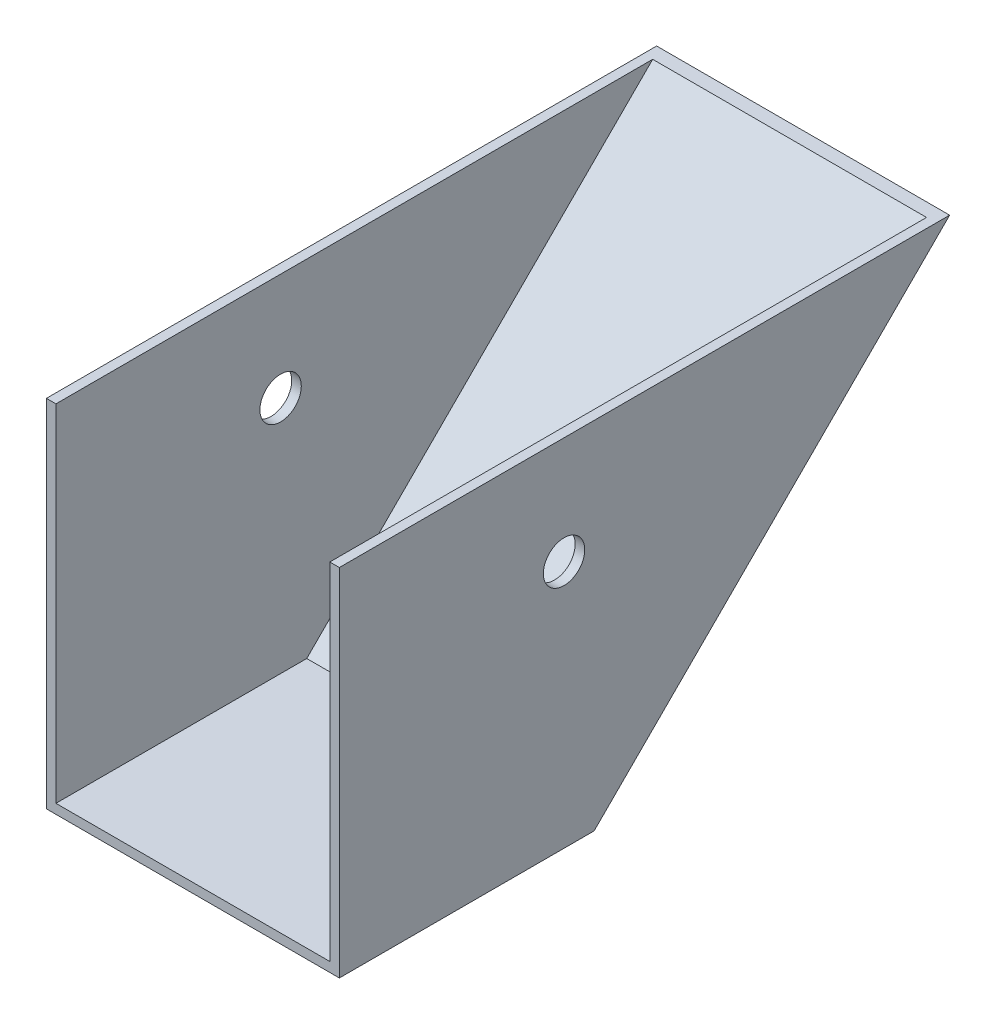
ISO-10303-21;
HEADER;
FILE_DESCRIPTION(('STEP AP214'),'2;1');
FILE_NAME('part.step','',(''),(''),'','','');
FILE_SCHEMA(('AUTOMOTIVE_DESIGN { 1 0 10303 214 1 1 1 1 }'));
ENDSEC;
DATA;
#1=APPLICATION_CONTEXT('core data for automotive mechanical design processes');
#2=APPLICATION_PROTOCOL_DEFINITION('international standard','automotive_design',2000,#1);
#3=PRODUCT_CONTEXT('',#1,'mechanical');
#4=PRODUCT('Part','Part','',(#3));
#5=PRODUCT_RELATED_PRODUCT_CATEGORY('part','',(#4));
#6=PRODUCT_DEFINITION_FORMATION('','',#4);
#7=PRODUCT_DEFINITION_CONTEXT('part definition',#1,'design');
#8=PRODUCT_DEFINITION('design','',#6,#7);
#9=PRODUCT_DEFINITION_SHAPE('','',#8);
#10=(LENGTH_UNIT() NAMED_UNIT(*) SI_UNIT(.MILLI.,.METRE.));
#11=(NAMED_UNIT(*) PLANE_ANGLE_UNIT() SI_UNIT($,.RADIAN.));
#12=(NAMED_UNIT(*) SI_UNIT($,.STERADIAN.) SOLID_ANGLE_UNIT());
#13=UNCERTAINTY_MEASURE_WITH_UNIT(LENGTH_MEASURE(1.E-05),#10,'distance_accuracy_value','');
#14=(GEOMETRIC_REPRESENTATION_CONTEXT(3) GLOBAL_UNCERTAINTY_ASSIGNED_CONTEXT((#13)) GLOBAL_UNIT_ASSIGNED_CONTEXT((#10,
#11,#12)) REPRESENTATION_CONTEXT('',''));
#15=CARTESIAN_POINT('',(0.,0.,0.));
#16=DIRECTION('',(0.,0.,1.));
#17=DIRECTION('',(1.,0.,0.));
#18=AXIS2_PLACEMENT_3D('',#15,#16,#17);
#19=CARTESIAN_POINT('',(-146.05,190.5,317.5));
#20=DIRECTION('',(0.,0.,-1.));
#21=DIRECTION('',(-1.,0.,0.));
#22=AXIS2_PLACEMENT_3D('',#19,#20,#21);
#23=PLANE('',#22);
#24=DIRECTION('',(1.,0.,0.));
#25=VECTOR('',#24,1.);
#26=CARTESIAN_POINT('',(-146.05,163.914666666667,317.5));
#27=LINE('',#26,#25);
#28=CARTESIAN_POINT('',(-146.05,163.914666666667,317.5));
#29=VERTEX_POINT('',#28);
#30=CARTESIAN_POINT('',(-136.525,163.914666666667,317.5));
#31=VERTEX_POINT('',#30);
#32=EDGE_CURVE('E100',#29,#31,#27,.T.);
#33=ORIENTED_EDGE('',*,*,#32,.F.);
#34=DIRECTION('',(0.,-1.,0.));
#35=VECTOR('',#34,1.);
#36=CARTESIAN_POINT('',(-146.05,190.5,317.5));
#37=LINE('',#36,#35);
#38=CARTESIAN_POINT('',(-146.05,-190.5,317.5));
#39=VERTEX_POINT('',#38);
#40=EDGE_CURVE('E111',#29,#39,#37,.T.);
#41=ORIENTED_EDGE('',*,*,#40,.T.);
#42=DIRECTION('',(1.,0.,0.));
#43=VECTOR('',#42,1.);
#44=CARTESIAN_POINT('',(-146.05,-190.5,317.5));
#45=LINE('',#44,#43);
#46=CARTESIAN_POINT('',(146.05,-190.5,317.5));
#47=VERTEX_POINT('',#46);
#48=EDGE_CURVE('E124',#39,#47,#45,.T.);
#49=ORIENTED_EDGE('',*,*,#48,.T.);
#50=DIRECTION('',(0.,-1.,0.));
#51=VECTOR('',#50,1.);
#52=CARTESIAN_POINT('',(146.05,190.5,317.5));
#53=LINE('',#52,#51);
#54=CARTESIAN_POINT('',(146.05,163.914666666667,317.5));
#55=VERTEX_POINT('',#54);
#56=EDGE_CURVE('E121',#55,#47,#53,.T.);
#57=ORIENTED_EDGE('',*,*,#56,.F.);
#58=CARTESIAN_POINT('',(136.525,163.914666666667,317.5));
#59=VERTEX_POINT('',#58);
#60=EDGE_CURVE('E106',#59,#55,#27,.T.);
#61=ORIENTED_EDGE('',*,*,#60,.F.);
#62=DIRECTION('',(0.,-1.,0.));
#63=VECTOR('',#62,1.);
#64=CARTESIAN_POINT('',(136.525,190.5,317.5));
#65=LINE('',#64,#63);
#66=CARTESIAN_POINT('',(136.525,-180.975,317.5));
#67=VERTEX_POINT('',#66);
#68=EDGE_CURVE('E162',#59,#67,#65,.T.);
#69=ORIENTED_EDGE('',*,*,#68,.T.);
#70=DIRECTION('',(1.,0.,0.));
#71=VECTOR('',#70,1.);
#72=CARTESIAN_POINT('',(0.,-180.975,317.5));
#73=LINE('',#72,#71);
#74=CARTESIAN_POINT('',(-136.525,-180.975,317.5));
#75=VERTEX_POINT('',#74);
#76=EDGE_CURVE('E158',#75,#67,#73,.T.);
#77=ORIENTED_EDGE('',*,*,#76,.F.);
#78=DIRECTION('',(0.,-1.,0.));
#79=VECTOR('',#78,1.);
#80=CARTESIAN_POINT('',(-136.525,190.5,317.5));
#81=LINE('',#80,#79);
#82=EDGE_CURVE('E114',#31,#75,#81,.T.);
#83=ORIENTED_EDGE('',*,*,#82,.F.);
#84=EDGE_LOOP('',(#33,#41,#49,#57,#61,#69,#77,#83));
#85=FACE_BOUND('',#84,.T.);
#86=ADVANCED_FACE('F34',(#85),#23,.F.);
#87=CARTESIAN_POINT('',(146.05,190.5,317.5));
#88=DIRECTION('',(-1.,0.,0.));
#89=DIRECTION('',(0.,0.,1.));
#90=AXIS2_PLACEMENT_3D('',#87,#88,#89);
#91=PLANE('',#90);
#92=CARTESIAN_POINT('',(146.05,56.9612089146503,93.5172925237751));
#93=DIRECTION('',(-1.,0.,0.));
#94=DIRECTION('',(0.,0.,1.));
#95=AXIS2_PLACEMENT_3D('',#92,#93,#94);
#96=CIRCLE('',#95,20.6375);
#97=CARTESIAN_POINT('',(146.05,56.9612089146503,114.154792523775));
#98=VERTEX_POINT('',#97);
#99=EDGE_CURVE('E134',#98,#98,#96,.T.);
#100=ORIENTED_EDGE('',*,*,#99,.T.);
#101=EDGE_LOOP('',(#100));
#102=FACE_BOUND('',#101,.T.);
#103=DIRECTION('',(0.,0.,-1.));
#104=VECTOR('',#103,1.);
#105=CARTESIAN_POINT('',(146.05,163.914666666667,-292.608));
#106=LINE('',#105,#104);
#107=CARTESIAN_POINT('',(146.05,163.914666666667,-290.914666666667));
#108=VERTEX_POINT('',#107);
#109=EDGE_CURVE('E115',#55,#108,#106,.T.);
#110=ORIENTED_EDGE('',*,*,#109,.F.);
#111=ORIENTED_EDGE('',*,*,#56,.T.);
#112=DIRECTION('',(0.,0.,-1.));
#113=VECTOR('',#112,1.);
#114=CARTESIAN_POINT('',(146.05,-190.5,317.5));
#115=LINE('',#114,#113);
#116=CARTESIAN_POINT('',(146.05,-190.5,63.5000000000015));
#117=VERTEX_POINT('',#116);
#118=EDGE_CURVE('E169',#47,#117,#115,.T.);
#119=ORIENTED_EDGE('',*,*,#118,.T.);
#120=DIRECTION('',(0.,0.707106781186546,-0.707106781186549));
#121=VECTOR('',#120,1.);
#122=CARTESIAN_POINT('',(146.05,-127.,1.16573417585641E-12));
#123=LINE('',#122,#121);
#124=EDGE_CURVE('E56',#117,#108,#123,.T.);
#125=ORIENTED_EDGE('',*,*,#124,.T.);
#126=EDGE_LOOP('',(#110,#111,#119,#125));
#127=FACE_BOUND('',#126,.T.);
#128=ADVANCED_FACE('F36',(#102,#127),#91,.F.);
#129=CARTESIAN_POINT('',(-146.05,190.5,317.5));
#130=DIRECTION('',(1.,0.,0.));
#131=DIRECTION('',(0.,0.,-1.));
#132=AXIS2_PLACEMENT_3D('',#129,#130,#131);
#133=PLANE('',#132);
#134=CARTESIAN_POINT('',(-146.05,56.9612089146503,93.5172925237751));
#135=DIRECTION('',(-1.,0.,0.));
#136=DIRECTION('',(0.,0.,1.));
#137=AXIS2_PLACEMENT_3D('',#134,#135,#136);
#138=CIRCLE('',#137,20.6375);
#139=CARTESIAN_POINT('',(-146.05,56.9612089146503,114.154792523775));
#140=VERTEX_POINT('',#139);
#141=EDGE_CURVE('E130',#140,#140,#138,.T.);
#142=ORIENTED_EDGE('',*,*,#141,.F.);
#143=EDGE_LOOP('',(#142));
#144=FACE_BOUND('',#143,.T.);
#145=DIRECTION('',(0.,0.,1.));
#146=VECTOR('',#145,1.);
#147=CARTESIAN_POINT('',(-146.05,163.914666666667,-292.608));
#148=LINE('',#147,#146);
#149=CARTESIAN_POINT('',(-146.05,163.914666666667,-290.914666666667));
#150=VERTEX_POINT('',#149);
#151=EDGE_CURVE('E97',#150,#29,#148,.T.);
#152=ORIENTED_EDGE('',*,*,#151,.F.);
#153=DIRECTION('',(0.,0.707106781186546,-0.707106781186549));
#154=VECTOR('',#153,1.);
#155=CARTESIAN_POINT('',(-146.05,190.5,-317.5));
#156=LINE('',#155,#154);
#157=CARTESIAN_POINT('',(-146.05,-190.5,63.5000000000013));
#158=VERTEX_POINT('',#157);
#159=EDGE_CURVE('E161',#158,#150,#156,.T.);
#160=ORIENTED_EDGE('',*,*,#159,.F.);
#161=DIRECTION('',(0.,0.,1.));
#162=VECTOR('',#161,1.);
#163=CARTESIAN_POINT('',(-146.05,-190.5,317.5));
#164=LINE('',#163,#162);
#165=EDGE_CURVE('E119',#158,#39,#164,.T.);
#166=ORIENTED_EDGE('',*,*,#165,.T.);
#167=ORIENTED_EDGE('',*,*,#40,.F.);
#168=EDGE_LOOP('',(#152,#160,#166,#167));
#169=FACE_BOUND('',#168,.T.);
#170=ADVANCED_FACE('F117',(#144,#169),#133,.F.);
#171=CARTESIAN_POINT('',(234.95,190.5,-317.5));
#172=DIRECTION('',(0.,0.707106781186549,0.707106781186546));
#173=DIRECTION('',(0.,-0.707106781186546,0.707106781186549));
#174=AXIS2_PLACEMENT_3D('',#171,#172,#173);
#175=PLANE('',#174);
#176=DIRECTION('',(-1.,0.,0.));
#177=VECTOR('',#176,1.);
#178=CARTESIAN_POINT('',(234.95,163.914666666667,-290.914666666667));
#179=LINE('',#178,#177);
#180=EDGE_CURVE('E101',#108,#150,#179,.T.);
#181=ORIENTED_EDGE('',*,*,#180,.F.);
#182=ORIENTED_EDGE('',*,*,#124,.F.);
#183=DIRECTION('',(-1.,0.,0.));
#184=VECTOR('',#183,1.);
#185=CARTESIAN_POINT('',(0.,-190.5,63.5000000000014));
#186=LINE('',#185,#184);
#187=EDGE_CURVE('E42',#117,#158,#186,.T.);
#188=ORIENTED_EDGE('',*,*,#187,.T.);
#189=ORIENTED_EDGE('',*,*,#159,.T.);
#190=EDGE_LOOP('',(#181,#182,#188,#189));
#191=FACE_BOUND('',#190,.T.);
#192=ADVANCED_FACE('F203',(#191),#175,.F.);
#193=CARTESIAN_POINT('',(136.525,190.5,317.5));
#194=DIRECTION('',(-1.,0.,0.));
#195=DIRECTION('',(0.,0.,1.));
#196=AXIS2_PLACEMENT_3D('',#193,#194,#195);
#197=PLANE('',#196);
#198=CARTESIAN_POINT('',(136.525,56.9612089146503,93.5172925237751));
#199=DIRECTION('',(-1.,0.,0.));
#200=DIRECTION('',(0.,0.,1.));
#201=AXIS2_PLACEMENT_3D('',#198,#199,#200);
#202=CIRCLE('',#201,20.6375);
#203=CARTESIAN_POINT('',(136.525,56.9612089146503,114.154792523775));
#204=VERTEX_POINT('',#203);
#205=EDGE_CURVE('E129',#204,#204,#202,.T.);
#206=ORIENTED_EDGE('',*,*,#205,.F.);
#207=EDGE_LOOP('',(#206));
#208=FACE_BOUND('',#207,.T.);
#209=ORIENTED_EDGE('',*,*,#68,.F.);
#210=DIRECTION('',(0.,0.,-1.));
#211=VECTOR('',#210,1.);
#212=CARTESIAN_POINT('',(136.525,163.914666666667,317.5));
#213=LINE('',#212,#211);
#214=CARTESIAN_POINT('',(136.525,163.914666666667,-277.444282485063));
#215=VERTEX_POINT('',#214);
#216=EDGE_CURVE('E140',#59,#215,#213,.T.);
#217=ORIENTED_EDGE('',*,*,#216,.T.);
#218=DIRECTION('',(0.,0.707106781186546,-0.707106781186549));
#219=VECTOR('',#218,1.);
#220=CARTESIAN_POINT('',(136.525,-120.264807909198,6.73519209080303));
#221=LINE('',#220,#219);
#222=CARTESIAN_POINT('',(136.525,-180.975,67.4453841816051));
#223=VERTEX_POINT('',#222);
#224=EDGE_CURVE('E151',#223,#215,#221,.T.);
#225=ORIENTED_EDGE('',*,*,#224,.F.);
#226=DIRECTION('',(0.,0.,-1.));
#227=VECTOR('',#226,1.);
#228=CARTESIAN_POINT('',(136.525,-180.975,0.));
#229=LINE('',#228,#227);
#230=EDGE_CURVE('E147',#67,#223,#229,.T.);
#231=ORIENTED_EDGE('',*,*,#230,.F.);
#232=EDGE_LOOP('',(#209,#217,#225,#231));
#233=FACE_BOUND('',#232,.T.);
#234=ADVANCED_FACE('F184',(#208,#233),#197,.T.);
#235=CARTESIAN_POINT('',(-136.525,190.5,317.5));
#236=DIRECTION('',(1.,0.,0.));
#237=DIRECTION('',(0.,0.,-1.));
#238=AXIS2_PLACEMENT_3D('',#235,#236,#237);
#239=PLANE('',#238);
#240=CARTESIAN_POINT('',(-136.525,56.9612089146503,93.5172925237751));
#241=DIRECTION('',(1.,0.,0.));
#242=DIRECTION('',(0.,0.,-1.));
#243=AXIS2_PLACEMENT_3D('',#240,#241,#242);
#244=CIRCLE('',#243,20.6375);
#245=CARTESIAN_POINT('',(-136.525,56.9612089146503,72.8797925237751));
#246=VERTEX_POINT('',#245);
#247=EDGE_CURVE('E127',#246,#246,#244,.T.);
#248=ORIENTED_EDGE('',*,*,#247,.F.);
#249=EDGE_LOOP('',(#248));
#250=FACE_BOUND('',#249,.T.);
#251=DIRECTION('',(0.,0.707106781186546,-0.707106781186549));
#252=VECTOR('',#251,1.);
#253=CARTESIAN_POINT('',(-136.525,197.235192090802,-310.764807909198));
#254=LINE('',#253,#252);
#255=CARTESIAN_POINT('',(-136.525,-180.975,67.445384181605));
#256=VERTEX_POINT('',#255);
#257=CARTESIAN_POINT('',(-136.525,163.914666666667,-277.444282485063));
#258=VERTEX_POINT('',#257);
#259=EDGE_CURVE('E146',#256,#258,#254,.T.);
#260=ORIENTED_EDGE('',*,*,#259,.T.);
#261=DIRECTION('',(0.,0.,1.));
#262=VECTOR('',#261,1.);
#263=CARTESIAN_POINT('',(-136.525,163.914666666667,317.5));
#264=LINE('',#263,#262);
#265=EDGE_CURVE('E49',#258,#31,#264,.T.);
#266=ORIENTED_EDGE('',*,*,#265,.T.);
#267=ORIENTED_EDGE('',*,*,#82,.T.);
#268=DIRECTION('',(0.,0.,1.));
#269=VECTOR('',#268,1.);
#270=CARTESIAN_POINT('',(-136.525,-180.975,0.));
#271=LINE('',#270,#269);
#272=EDGE_CURVE('E150',#256,#75,#271,.T.);
#273=ORIENTED_EDGE('',*,*,#272,.F.);
#274=EDGE_LOOP('',(#260,#266,#267,#273));
#275=FACE_BOUND('',#274,.T.);
#276=ADVANCED_FACE('F194',(#250,#275),#239,.T.);
#277=CARTESIAN_POINT('',(234.95,197.235192090802,-310.764807909198));
#278=DIRECTION('',(0.,0.707106781186549,0.707106781186546));
#279=DIRECTION('',(0.,-0.707106781186546,0.707106781186549));
#280=AXIS2_PLACEMENT_3D('',#277,#278,#279);
#281=PLANE('',#280);
#282=ORIENTED_EDGE('',*,*,#224,.T.);
#283=DIRECTION('',(-1.,0.,0.));
#284=VECTOR('',#283,1.);
#285=CARTESIAN_POINT('',(234.95,163.914666666667,-277.444282485063));
#286=LINE('',#285,#284);
#287=EDGE_CURVE('E11',#215,#258,#286,.T.);
#288=ORIENTED_EDGE('',*,*,#287,.T.);
#289=ORIENTED_EDGE('',*,*,#259,.F.);
#290=DIRECTION('',(-1.,0.,0.));
#291=VECTOR('',#290,1.);
#292=CARTESIAN_POINT('',(0.,-180.975,67.4453841816051));
#293=LINE('',#292,#291);
#294=EDGE_CURVE('E159',#223,#256,#293,.T.);
#295=ORIENTED_EDGE('',*,*,#294,.F.);
#296=EDGE_LOOP('',(#282,#288,#289,#295));
#297=FACE_BOUND('',#296,.T.);
#298=ADVANCED_FACE('F188',(#297),#281,.T.);
#299=CARTESIAN_POINT('',(0.,-190.5,0.));
#300=DIRECTION('',(0.,-1.,0.));
#301=DIRECTION('',(0.,0.,-1.));
#302=AXIS2_PLACEMENT_3D('',#299,#300,#301);
#303=PLANE('',#302);
#304=ORIENTED_EDGE('',*,*,#187,.F.);
#305=ORIENTED_EDGE('',*,*,#118,.F.);
#306=ORIENTED_EDGE('',*,*,#48,.F.);
#307=ORIENTED_EDGE('',*,*,#165,.F.);
#308=EDGE_LOOP('',(#304,#305,#306,#307));
#309=FACE_BOUND('',#308,.T.);
#310=ADVANCED_FACE('F176',(#309),#303,.T.);
#311=CARTESIAN_POINT('',(0.,-180.975,0.));
#312=DIRECTION('',(0.,-1.,0.));
#313=DIRECTION('',(0.,0.,-1.));
#314=AXIS2_PLACEMENT_3D('',#311,#312,#313);
#315=PLANE('',#314);
#316=ORIENTED_EDGE('',*,*,#294,.T.);
#317=ORIENTED_EDGE('',*,*,#272,.T.);
#318=ORIENTED_EDGE('',*,*,#76,.T.);
#319=ORIENTED_EDGE('',*,*,#230,.T.);
#320=EDGE_LOOP('',(#316,#317,#318,#319));
#321=FACE_BOUND('',#320,.T.);
#322=ADVANCED_FACE('F192',(#321),#315,.F.);
#323=CARTESIAN_POINT('',(368.046000000001,56.9612089146503,93.5172925237751));
#324=DIRECTION('',(-1.,0.,0.));
#325=DIRECTION('',(0.,0.,1.));
#326=AXIS2_PLACEMENT_3D('',#323,#324,#325);
#327=CYLINDRICAL_SURFACE('',#326,20.6375);
#328=ORIENTED_EDGE('',*,*,#247,.T.);
#329=EDGE_LOOP('',(#328));
#330=FACE_BOUND('',#329,.T.);
#331=ORIENTED_EDGE('',*,*,#141,.T.);
#332=EDGE_LOOP('',(#331));
#333=FACE_BOUND('',#332,.T.);
#334=ADVANCED_FACE('F223',(#330,#333),#327,.F.);
#335=ORIENTED_EDGE('',*,*,#205,.T.);
#336=EDGE_LOOP('',(#335));
#337=FACE_BOUND('',#336,.T.);
#338=ORIENTED_EDGE('',*,*,#99,.F.);
#339=EDGE_LOOP('',(#338));
#340=FACE_BOUND('',#339,.T.);
#341=ADVANCED_FACE('F228',(#337,#340),#327,.F.);
#342=CARTESIAN_POINT('',(0.,163.914666666667,0.));
#343=DIRECTION('',(0.,1.,0.));
#344=DIRECTION('',(0.,0.,1.));
#345=AXIS2_PLACEMENT_3D('',#342,#343,#344);
#346=PLANE('',#345);
#347=ORIENTED_EDGE('',*,*,#180,.T.);
#348=ORIENTED_EDGE('',*,*,#151,.T.);
#349=ORIENTED_EDGE('',*,*,#32,.T.);
#350=ORIENTED_EDGE('',*,*,#265,.F.);
#351=ORIENTED_EDGE('',*,*,#287,.F.);
#352=ORIENTED_EDGE('',*,*,#216,.F.);
#353=ORIENTED_EDGE('',*,*,#60,.T.);
#354=ORIENTED_EDGE('',*,*,#109,.T.);
#355=EDGE_LOOP('',(#347,#348,#349,#350,#351,#352,#353,#354));
#356=FACE_BOUND('',#355,.T.);
#357=ADVANCED_FACE('F99',(#356),#346,.T.);
#358=CLOSED_SHELL('',(#86,#128,#170,#192,#234,#276,#298,#310,#322,#334,#341,#357));
#359=MANIFOLD_SOLID_BREP('B2',#358);
#360=ADVANCED_BREP_SHAPE_REPRESENTATION('',(#18,#359),#14);
#361=SHAPE_DEFINITION_REPRESENTATION(#9,#360);
ENDSEC;
END-ISO-10303-21;
